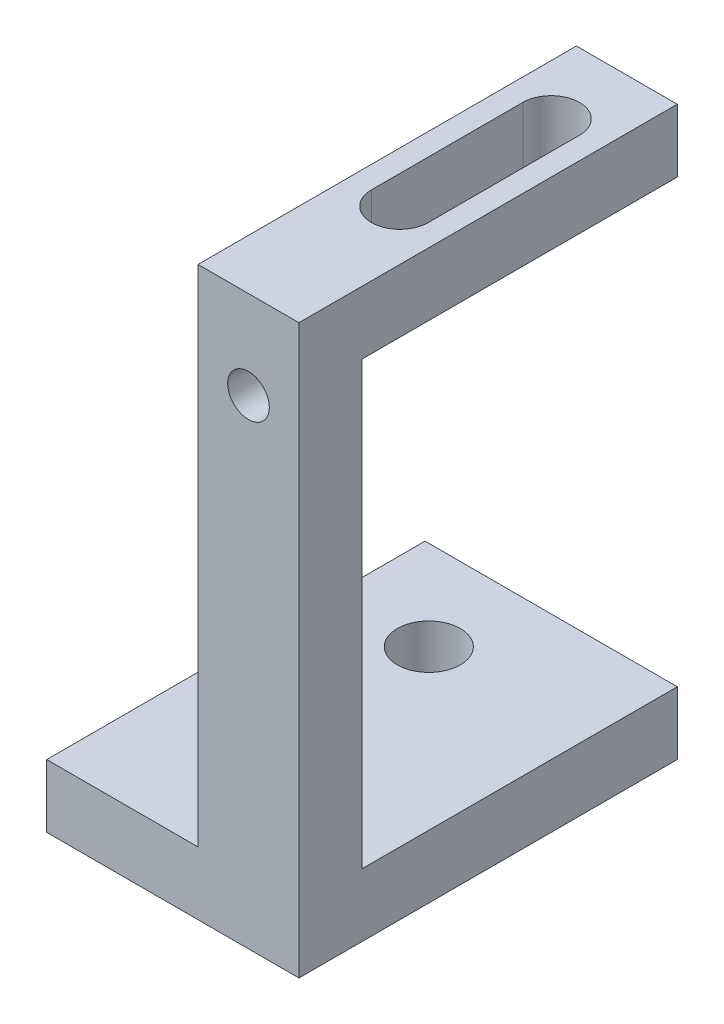
ISO-10303-21;
HEADER;
FILE_DESCRIPTION(('STEP AP214'),'2;1');
FILE_NAME('part.step','',(''),(''),'','','');
FILE_SCHEMA(('AUTOMOTIVE_DESIGN { 1 0 10303 214 1 1 1 1 }'));
ENDSEC;
DATA;
#1=APPLICATION_CONTEXT('core data for automotive mechanical design processes');
#2=APPLICATION_PROTOCOL_DEFINITION('international standard','automotive_design',2000,#1);
#3=PRODUCT_CONTEXT('',#1,'mechanical');
#4=PRODUCT('Part','Part','',(#3));
#5=PRODUCT_RELATED_PRODUCT_CATEGORY('part','',(#4));
#6=PRODUCT_DEFINITION_FORMATION('','',#4);
#7=PRODUCT_DEFINITION_CONTEXT('part definition',#1,'design');
#8=PRODUCT_DEFINITION('design','',#6,#7);
#9=PRODUCT_DEFINITION_SHAPE('','',#8);
#10=(LENGTH_UNIT() NAMED_UNIT(*) SI_UNIT(.MILLI.,.METRE.));
#11=(NAMED_UNIT(*) PLANE_ANGLE_UNIT() SI_UNIT($,.RADIAN.));
#12=(NAMED_UNIT(*) SI_UNIT($,.STERADIAN.) SOLID_ANGLE_UNIT());
#13=UNCERTAINTY_MEASURE_WITH_UNIT(LENGTH_MEASURE(1.E-05),#10,'distance_accuracy_value','');
#14=(GEOMETRIC_REPRESENTATION_CONTEXT(3) GLOBAL_UNCERTAINTY_ASSIGNED_CONTEXT((#13)) GLOBAL_UNIT_ASSIGNED_CONTEXT((#10,
#11,#12)) REPRESENTATION_CONTEXT('',''));
#15=CARTESIAN_POINT('',(0.,0.,0.));
#16=DIRECTION('',(0.,0.,1.));
#17=DIRECTION('',(1.,0.,0.));
#18=AXIS2_PLACEMENT_3D('',#15,#16,#17);
#19=CARTESIAN_POINT('',(0.,0.,10.));
#20=DIRECTION('',(1.,0.,0.));
#21=DIRECTION('',(0.,1.,0.));
#22=AXIS2_PLACEMENT_3D('',#19,#20,#21);
#23=PLANE('',#22);
#24=DIRECTION('',(0.,0.,-1.));
#25=VECTOR('',#24,1.);
#26=CARTESIAN_POINT('',(0.,15.,5.));
#27=LINE('',#26,#25);
#28=CARTESIAN_POINT('',(0.,15.,5.));
#29=VERTEX_POINT('',#28);
#30=CARTESIAN_POINT('',(0.,15.,-20.));
#31=VERTEX_POINT('',#30);
#32=EDGE_CURVE('E225',#29,#31,#27,.T.);
#33=ORIENTED_EDGE('',*,*,#32,.F.);
#34=DIRECTION('',(0.,1.,0.));
#35=VECTOR('',#34,1.);
#36=CARTESIAN_POINT('',(0.,0.,5.));
#37=LINE('',#36,#35);
#38=CARTESIAN_POINT('',(0.,-20.,5.));
#39=VERTEX_POINT('',#38);
#40=EDGE_CURVE('E222',#39,#29,#37,.T.);
#41=ORIENTED_EDGE('',*,*,#40,.F.);
#42=DIRECTION('',(0.,0.,-1.));
#43=VECTOR('',#42,1.);
#44=CARTESIAN_POINT('',(0.,-20.,5.));
#45=LINE('',#44,#43);
#46=CARTESIAN_POINT('',(0.,-20.,10.));
#47=VERTEX_POINT('',#46);
#48=EDGE_CURVE('E216',#47,#39,#45,.T.);
#49=ORIENTED_EDGE('',*,*,#48,.F.);
#50=DIRECTION('',(0.,-1.,0.));
#51=VECTOR('',#50,1.);
#52=CARTESIAN_POINT('',(0.,0.,10.));
#53=LINE('',#52,#51);
#54=CARTESIAN_POINT('',(0.,20.,10.));
#55=VERTEX_POINT('',#54);
#56=EDGE_CURVE('E231',#55,#47,#53,.T.);
#57=ORIENTED_EDGE('',*,*,#56,.F.);
#58=DIRECTION('',(0.,0.,-1.));
#59=VECTOR('',#58,1.);
#60=CARTESIAN_POINT('',(0.,20.,10.));
#61=LINE('',#60,#59);
#62=CARTESIAN_POINT('',(0.,20.,-20.));
#63=VERTEX_POINT('',#62);
#64=EDGE_CURVE('E237',#55,#63,#61,.T.);
#65=ORIENTED_EDGE('',*,*,#64,.T.);
#66=DIRECTION('',(0.,1.,0.));
#67=VECTOR('',#66,1.);
#68=CARTESIAN_POINT('',(0.,20.,-20.));
#69=LINE('',#68,#67);
#70=EDGE_CURVE('E177',#31,#63,#69,.T.);
#71=ORIENTED_EDGE('',*,*,#70,.F.);
#72=EDGE_LOOP('',(#33,#41,#49,#57,#65,#71));
#73=FACE_BOUND('',#72,.T.);
#74=ADVANCED_FACE('F49',(#73),#23,.F.);
#75=CARTESIAN_POINT('',(8.,0.,10.));
#76=DIRECTION('',(-1.,0.,0.));
#77=DIRECTION('',(0.,-1.,0.));
#78=AXIS2_PLACEMENT_3D('',#75,#76,#77);
#79=PLANE('',#78);
#80=DIRECTION('',(0.,1.,0.));
#81=VECTOR('',#80,1.);
#82=CARTESIAN_POINT('',(8.,0.,10.));
#83=LINE('',#82,#81);
#84=CARTESIAN_POINT('',(8.,-25.,10.));
#85=VERTEX_POINT('',#84);
#86=CARTESIAN_POINT('',(8.,20.,10.));
#87=VERTEX_POINT('',#86);
#88=EDGE_CURVE('E233',#85,#87,#83,.T.);
#89=ORIENTED_EDGE('',*,*,#88,.F.);
#90=DIRECTION('',(0.,0.,1.));
#91=VECTOR('',#90,1.);
#92=CARTESIAN_POINT('',(8.,-25.,10.));
#93=LINE('',#92,#91);
#94=CARTESIAN_POINT('',(8.,-25.,-20.));
#95=VERTEX_POINT('',#94);
#96=EDGE_CURVE('E190',#95,#85,#93,.T.);
#97=ORIENTED_EDGE('',*,*,#96,.F.);
#98=DIRECTION('',(0.,1.,0.));
#99=VECTOR('',#98,1.);
#100=CARTESIAN_POINT('',(8.,-25.,-20.));
#101=LINE('',#100,#99);
#102=CARTESIAN_POINT('',(8.,-20.,-20.));
#103=VERTEX_POINT('',#102);
#104=EDGE_CURVE('E200',#95,#103,#101,.T.);
#105=ORIENTED_EDGE('',*,*,#104,.T.);
#106=DIRECTION('',(0.,0.,1.));
#107=VECTOR('',#106,1.);
#108=CARTESIAN_POINT('',(8.,-20.,10.));
#109=LINE('',#108,#107);
#110=CARTESIAN_POINT('',(8.,-20.,5.));
#111=VERTEX_POINT('',#110);
#112=EDGE_CURVE('E187',#103,#111,#109,.T.);
#113=ORIENTED_EDGE('',*,*,#112,.T.);
#114=DIRECTION('',(0.,1.,0.));
#115=VECTOR('',#114,1.);
#116=CARTESIAN_POINT('',(8.,0.,5.));
#117=LINE('',#116,#115);
#118=CARTESIAN_POINT('',(8.,15.,5.));
#119=VERTEX_POINT('',#118);
#120=EDGE_CURVE('E241',#111,#119,#117,.T.);
#121=ORIENTED_EDGE('',*,*,#120,.T.);
#122=DIRECTION('',(0.,0.,-1.));
#123=VECTOR('',#122,1.);
#124=CARTESIAN_POINT('',(8.,15.,9.99999999999998));
#125=LINE('',#124,#123);
#126=CARTESIAN_POINT('',(8.,15.,-20.));
#127=VERTEX_POINT('',#126);
#128=EDGE_CURVE('E229',#119,#127,#125,.T.);
#129=ORIENTED_EDGE('',*,*,#128,.T.);
#130=DIRECTION('',(0.,-1.,0.));
#131=VECTOR('',#130,1.);
#132=CARTESIAN_POINT('',(8.,20.,-20.));
#133=LINE('',#132,#131);
#134=CARTESIAN_POINT('',(8.,20.,-20.));
#135=VERTEX_POINT('',#134);
#136=EDGE_CURVE('E169',#135,#127,#133,.T.);
#137=ORIENTED_EDGE('',*,*,#136,.F.);
#138=DIRECTION('',(0.,0.,-1.));
#139=VECTOR('',#138,1.);
#140=CARTESIAN_POINT('',(8.,20.,10.));
#141=LINE('',#140,#139);
#142=EDGE_CURVE('E239',#87,#135,#141,.T.);
#143=ORIENTED_EDGE('',*,*,#142,.F.);
#144=EDGE_LOOP('',(#89,#97,#105,#113,#121,#129,#137,#143));
#145=FACE_BOUND('',#144,.T.);
#146=ADVANCED_FACE('F267',(#145),#79,.F.);
#147=CARTESIAN_POINT('',(0.,20.,10.));
#148=DIRECTION('',(0.,-1.,0.));
#149=DIRECTION('',(0.,0.,-1.));
#150=AXIS2_PLACEMENT_3D('',#147,#148,#149);
#151=PLANE('',#150);
#152=DIRECTION('',(0.,0.,1.));
#153=VECTOR('',#152,1.);
#154=CARTESIAN_POINT('',(1.75,20.,-14.));
#155=LINE('',#154,#153);
#156=CARTESIAN_POINT('',(1.75,20.,-14.));
#157=VERTEX_POINT('',#156);
#158=CARTESIAN_POINT('',(1.75,20.,-2.));
#159=VERTEX_POINT('',#158);
#160=EDGE_CURVE('E155',#157,#159,#155,.T.);
#161=ORIENTED_EDGE('',*,*,#160,.F.);
#162=CARTESIAN_POINT('',(4.,20.,-14.));
#163=DIRECTION('',(0.,1.,0.));
#164=DIRECTION('',(0.,0.,1.));
#165=AXIS2_PLACEMENT_3D('',#162,#163,#164);
#166=CIRCLE('',#165,2.25);
#167=CARTESIAN_POINT('',(6.25,20.,-14.));
#168=VERTEX_POINT('',#167);
#169=EDGE_CURVE('E63',#168,#157,#166,.T.);
#170=ORIENTED_EDGE('',*,*,#169,.F.);
#171=DIRECTION('',(0.,0.,-1.));
#172=VECTOR('',#171,1.);
#173=CARTESIAN_POINT('',(6.25,20.,-14.));
#174=LINE('',#173,#172);
#175=CARTESIAN_POINT('',(6.25,20.,-2.));
#176=VERTEX_POINT('',#175);
#177=EDGE_CURVE('E162',#176,#168,#174,.T.);
#178=ORIENTED_EDGE('',*,*,#177,.F.);
#179=CARTESIAN_POINT('',(4.,20.,-2.));
#180=DIRECTION('',(0.,1.,0.));
#181=DIRECTION('',(0.,0.,1.));
#182=AXIS2_PLACEMENT_3D('',#179,#180,#181);
#183=CIRCLE('',#182,2.25);
#184=EDGE_CURVE('E146',#159,#176,#183,.T.);
#185=ORIENTED_EDGE('',*,*,#184,.F.);
#186=EDGE_LOOP('',(#161,#170,#178,#185));
#187=FACE_BOUND('',#186,.T.);
#188=ORIENTED_EDGE('',*,*,#142,.T.);
#189=DIRECTION('',(1.,0.,0.));
#190=VECTOR('',#189,1.);
#191=CARTESIAN_POINT('',(8.,20.,-20.));
#192=LINE('',#191,#190);
#193=EDGE_CURVE('E180',#63,#135,#192,.T.);
#194=ORIENTED_EDGE('',*,*,#193,.F.);
#195=ORIENTED_EDGE('',*,*,#64,.F.);
#196=DIRECTION('',(-1.,0.,0.));
#197=VECTOR('',#196,1.);
#198=CARTESIAN_POINT('',(0.,20.,10.));
#199=LINE('',#198,#197);
#200=EDGE_CURVE('E235',#87,#55,#199,.T.);
#201=ORIENTED_EDGE('',*,*,#200,.F.);
#202=EDGE_LOOP('',(#188,#194,#195,#201));
#203=FACE_BOUND('',#202,.T.);
#204=ADVANCED_FACE('F159',(#187,#203),#151,.F.);
#205=CARTESIAN_POINT('',(0.,0.,10.));
#206=DIRECTION('',(0.,0.,-1.));
#207=DIRECTION('',(-1.,0.,0.));
#208=AXIS2_PLACEMENT_3D('',#205,#206,#207);
#209=PLANE('',#208);
#210=CARTESIAN_POINT('',(4.,13.,10.));
#211=DIRECTION('',(0.,0.,1.));
#212=DIRECTION('',(1.,0.,0.));
#213=AXIS2_PLACEMENT_3D('',#210,#211,#212);
#214=CIRCLE('',#213,1.65);
#215=CARTESIAN_POINT('',(5.65,13.,10.));
#216=VERTEX_POINT('',#215);
#217=EDGE_CURVE('E419',#216,#216,#214,.T.);
#218=ORIENTED_EDGE('',*,*,#217,.F.);
#219=EDGE_LOOP('',(#218));
#220=FACE_BOUND('',#219,.T.);
#221=ORIENTED_EDGE('',*,*,#56,.T.);
#222=DIRECTION('',(-1.,0.,0.));
#223=VECTOR('',#222,1.);
#224=CARTESIAN_POINT('',(8.,-20.,10.));
#225=LINE('',#224,#223);
#226=CARTESIAN_POINT('',(-12.,-20.,10.));
#227=VERTEX_POINT('',#226);
#228=EDGE_CURVE('E203',#47,#227,#225,.T.);
#229=ORIENTED_EDGE('',*,*,#228,.T.);
#230=DIRECTION('',(0.,1.,0.));
#231=VECTOR('',#230,1.);
#232=CARTESIAN_POINT('',(-12.,-25.,10.));
#233=LINE('',#232,#231);
#234=CARTESIAN_POINT('',(-12.,-25.,10.));
#235=VERTEX_POINT('',#234);
#236=EDGE_CURVE('E213',#235,#227,#233,.T.);
#237=ORIENTED_EDGE('',*,*,#236,.F.);
#238=DIRECTION('',(-1.,0.,0.));
#239=VECTOR('',#238,1.);
#240=CARTESIAN_POINT('',(8.,-25.,10.));
#241=LINE('',#240,#239);
#242=EDGE_CURVE('E193',#85,#235,#241,.T.);
#243=ORIENTED_EDGE('',*,*,#242,.F.);
#244=ORIENTED_EDGE('',*,*,#88,.T.);
#245=ORIENTED_EDGE('',*,*,#200,.T.);
#246=EDGE_LOOP('',(#221,#229,#237,#243,#244,#245));
#247=FACE_BOUND('',#246,.T.);
#248=ADVANCED_FACE('F293',(#220,#247),#209,.F.);
#249=CARTESIAN_POINT('',(10.,0.,5.));
#250=DIRECTION('',(0.,0.,1.));
#251=DIRECTION('',(1.,0.,0.));
#252=AXIS2_PLACEMENT_3D('',#249,#250,#251);
#253=PLANE('',#252);
#254=CARTESIAN_POINT('',(4.,13.,5.));
#255=DIRECTION('',(0.,0.,1.));
#256=DIRECTION('',(1.,0.,0.));
#257=AXIS2_PLACEMENT_3D('',#254,#255,#256);
#258=CIRCLE('',#257,1.65);
#259=CARTESIAN_POINT('',(5.65,13.,5.));
#260=VERTEX_POINT('',#259);
#261=EDGE_CURVE('E422',#260,#260,#258,.T.);
#262=ORIENTED_EDGE('',*,*,#261,.T.);
#263=EDGE_LOOP('',(#262));
#264=FACE_BOUND('',#263,.T.);
#265=ORIENTED_EDGE('',*,*,#120,.F.);
#266=DIRECTION('',(1.,0.,0.));
#267=VECTOR('',#266,1.);
#268=CARTESIAN_POINT('',(0.,-20.,5.));
#269=LINE('',#268,#267);
#270=EDGE_CURVE('E219',#39,#111,#269,.T.);
#271=ORIENTED_EDGE('',*,*,#270,.F.);
#272=ORIENTED_EDGE('',*,*,#40,.T.);
#273=DIRECTION('',(-1.,0.,0.));
#274=VECTOR('',#273,1.);
#275=CARTESIAN_POINT('',(10.,15.,5.));
#276=LINE('',#275,#274);
#277=EDGE_CURVE('E227',#119,#29,#276,.T.);
#278=ORIENTED_EDGE('',*,*,#277,.F.);
#279=EDGE_LOOP('',(#265,#271,#272,#278));
#280=FACE_BOUND('',#279,.T.);
#281=ADVANCED_FACE('F284',(#264,#280),#253,.F.);
#282=CARTESIAN_POINT('',(10.,15.,5.));
#283=DIRECTION('',(0.,1.,0.));
#284=DIRECTION('',(0.,0.,1.));
#285=AXIS2_PLACEMENT_3D('',#282,#283,#284);
#286=PLANE('',#285);
#287=DIRECTION('',(0.,0.,-1.));
#288=VECTOR('',#287,1.);
#289=CARTESIAN_POINT('',(6.25,15.,5.));
#290=LINE('',#289,#288);
#291=CARTESIAN_POINT('',(6.25,15.,-2.));
#292=VERTEX_POINT('',#291);
#293=CARTESIAN_POINT('',(6.25,15.,-14.));
#294=VERTEX_POINT('',#293);
#295=EDGE_CURVE('E56',#292,#294,#290,.T.);
#296=ORIENTED_EDGE('',*,*,#295,.T.);
#297=CARTESIAN_POINT('',(4.,15.,-14.));
#298=DIRECTION('',(0.,1.,0.));
#299=DIRECTION('',(0.,0.,1.));
#300=AXIS2_PLACEMENT_3D('',#297,#298,#299);
#301=CIRCLE('',#300,2.25);
#302=CARTESIAN_POINT('',(1.75,15.,-14.));
#303=VERTEX_POINT('',#302);
#304=EDGE_CURVE('E13',#294,#303,#301,.T.);
#305=ORIENTED_EDGE('',*,*,#304,.T.);
#306=DIRECTION('',(0.,0.,1.));
#307=VECTOR('',#306,1.);
#308=CARTESIAN_POINT('',(1.75,15.,5.));
#309=LINE('',#308,#307);
#310=CARTESIAN_POINT('',(1.75,15.,-2.));
#311=VERTEX_POINT('',#310);
#312=EDGE_CURVE('E244',#303,#311,#309,.T.);
#313=ORIENTED_EDGE('',*,*,#312,.T.);
#314=CARTESIAN_POINT('',(4.,15.,-2.));
#315=DIRECTION('',(0.,1.,0.));
#316=DIRECTION('',(0.,0.,1.));
#317=AXIS2_PLACEMENT_3D('',#314,#315,#316);
#318=CIRCLE('',#317,2.25);
#319=EDGE_CURVE('E149',#311,#292,#318,.T.);
#320=ORIENTED_EDGE('',*,*,#319,.T.);
#321=EDGE_LOOP('',(#296,#305,#313,#320));
#322=FACE_BOUND('',#321,.T.);
#323=ORIENTED_EDGE('',*,*,#277,.T.);
#324=ORIENTED_EDGE('',*,*,#32,.T.);
#325=DIRECTION('',(-1.,0.,0.));
#326=VECTOR('',#325,1.);
#327=CARTESIAN_POINT('',(8.,15.,-20.));
#328=LINE('',#327,#326);
#329=EDGE_CURVE('E174',#127,#31,#328,.T.);
#330=ORIENTED_EDGE('',*,*,#329,.F.);
#331=ORIENTED_EDGE('',*,*,#128,.F.);
#332=EDGE_LOOP('',(#323,#324,#330,#331));
#333=FACE_BOUND('',#332,.T.);
#334=ADVANCED_FACE('F248',(#322,#333),#286,.F.);
#335=CARTESIAN_POINT('',(-12.,-25.,10.));
#336=DIRECTION('',(1.,0.,0.));
#337=DIRECTION('',(0.,0.,-1.));
#338=AXIS2_PLACEMENT_3D('',#335,#336,#337);
#339=PLANE('',#338);
#340=DIRECTION('',(0.,0.,-1.));
#341=VECTOR('',#340,1.);
#342=CARTESIAN_POINT('',(-12.,-20.,10.));
#343=LINE('',#342,#341);
#344=CARTESIAN_POINT('',(-12.,-20.,-20.));
#345=VERTEX_POINT('',#344);
#346=EDGE_CURVE('E205',#227,#345,#343,.T.);
#347=ORIENTED_EDGE('',*,*,#346,.T.);
#348=DIRECTION('',(0.,1.,0.));
#349=VECTOR('',#348,1.);
#350=CARTESIAN_POINT('',(-12.,-25.,-20.));
#351=LINE('',#350,#349);
#352=CARTESIAN_POINT('',(-12.,-25.,-20.));
#353=VERTEX_POINT('',#352);
#354=EDGE_CURVE('E210',#353,#345,#351,.T.);
#355=ORIENTED_EDGE('',*,*,#354,.F.);
#356=DIRECTION('',(0.,0.,-1.));
#357=VECTOR('',#356,1.);
#358=CARTESIAN_POINT('',(-12.,-25.,10.));
#359=LINE('',#358,#357);
#360=EDGE_CURVE('E196',#235,#353,#359,.T.);
#361=ORIENTED_EDGE('',*,*,#360,.F.);
#362=ORIENTED_EDGE('',*,*,#236,.T.);
#363=EDGE_LOOP('',(#347,#355,#361,#362));
#364=FACE_BOUND('',#363,.T.);
#365=ADVANCED_FACE('F309',(#364),#339,.F.);
#366=CARTESIAN_POINT('',(8.,-25.,-20.));
#367=DIRECTION('',(0.,0.,1.));
#368=DIRECTION('',(1.,0.,0.));
#369=AXIS2_PLACEMENT_3D('',#366,#367,#368);
#370=PLANE('',#369);
#371=DIRECTION('',(1.,0.,0.));
#372=VECTOR('',#371,1.);
#373=CARTESIAN_POINT('',(8.,-20.,-20.));
#374=LINE('',#373,#372);
#375=EDGE_CURVE('E194',#345,#103,#374,.T.);
#376=ORIENTED_EDGE('',*,*,#375,.T.);
#377=ORIENTED_EDGE('',*,*,#104,.F.);
#378=DIRECTION('',(1.,0.,0.));
#379=VECTOR('',#378,1.);
#380=CARTESIAN_POINT('',(8.,-25.,-20.));
#381=LINE('',#380,#379);
#382=EDGE_CURVE('E198',#353,#95,#381,.T.);
#383=ORIENTED_EDGE('',*,*,#382,.F.);
#384=ORIENTED_EDGE('',*,*,#354,.T.);
#385=EDGE_LOOP('',(#376,#377,#383,#384));
#386=FACE_BOUND('',#385,.T.);
#387=ADVANCED_FACE('F312',(#386),#370,.F.);
#388=CARTESIAN_POINT('',(0.,-25.,0.));
#389=DIRECTION('',(0.,1.,0.));
#390=DIRECTION('',(0.,0.,1.));
#391=AXIS2_PLACEMENT_3D('',#388,#389,#390);
#392=PLANE('',#391);
#393=CARTESIAN_POINT('',(-4.60000000000237,-25.,-12.8978974111214));
#394=DIRECTION('',(0.,1.,0.));
#395=DIRECTION('',(0.,0.,1.));
#396=AXIS2_PLACEMENT_3D('',#393,#394,#395);
#397=CIRCLE('',#396,2.5);
#398=CARTESIAN_POINT('',(-4.60000000000237,-25.,-10.3978974111214));
#399=VERTEX_POINT('',#398);
#400=EDGE_CURVE('E184',#399,#399,#397,.T.);
#401=ORIENTED_EDGE('',*,*,#400,.T.);
#402=EDGE_LOOP('',(#401));
#403=FACE_BOUND('',#402,.T.);
#404=ORIENTED_EDGE('',*,*,#96,.T.);
#405=ORIENTED_EDGE('',*,*,#242,.T.);
#406=ORIENTED_EDGE('',*,*,#360,.T.);
#407=ORIENTED_EDGE('',*,*,#382,.T.);
#408=EDGE_LOOP('',(#404,#405,#406,#407));
#409=FACE_BOUND('',#408,.T.);
#410=ADVANCED_FACE('F316',(#403,#409),#392,.F.);
#411=CARTESIAN_POINT('',(0.,-20.,0.));
#412=DIRECTION('',(0.,1.,0.));
#413=DIRECTION('',(0.,0.,1.));
#414=AXIS2_PLACEMENT_3D('',#411,#412,#413);
#415=PLANE('',#414);
#416=CARTESIAN_POINT('',(-4.60000000000237,-20.,-12.8978974111214));
#417=DIRECTION('',(0.,1.,0.));
#418=DIRECTION('',(0.,0.,1.));
#419=AXIS2_PLACEMENT_3D('',#416,#417,#418);
#420=CIRCLE('',#419,2.5);
#421=CARTESIAN_POINT('',(-4.60000000000237,-20.,-10.3978974111214));
#422=VERTEX_POINT('',#421);
#423=EDGE_CURVE('E183',#422,#422,#420,.T.);
#424=ORIENTED_EDGE('',*,*,#423,.F.);
#425=EDGE_LOOP('',(#424));
#426=FACE_BOUND('',#425,.T.);
#427=ORIENTED_EDGE('',*,*,#228,.F.);
#428=ORIENTED_EDGE('',*,*,#48,.T.);
#429=ORIENTED_EDGE('',*,*,#270,.T.);
#430=ORIENTED_EDGE('',*,*,#112,.F.);
#431=ORIENTED_EDGE('',*,*,#375,.F.);
#432=ORIENTED_EDGE('',*,*,#346,.F.);
#433=EDGE_LOOP('',(#427,#428,#429,#430,#431,#432));
#434=FACE_BOUND('',#433,.T.);
#435=ADVANCED_FACE('F288',(#426,#434),#415,.T.);
#436=CARTESIAN_POINT('',(-4.60000000000237,-25.,-12.8978974111214));
#437=DIRECTION('',(0.,1.,0.));
#438=DIRECTION('',(0.,0.,1.));
#439=AXIS2_PLACEMENT_3D('',#436,#437,#438);
#440=CYLINDRICAL_SURFACE('',#439,2.5);
#441=ORIENTED_EDGE('',*,*,#400,.F.);
#442=EDGE_LOOP('',(#441));
#443=FACE_BOUND('',#442,.T.);
#444=ORIENTED_EDGE('',*,*,#423,.T.);
#445=EDGE_LOOP('',(#444));
#446=FACE_BOUND('',#445,.T.);
#447=ADVANCED_FACE('F262',(#443,#446),#440,.F.);
#448=CARTESIAN_POINT('',(0.,0.,-20.));
#449=DIRECTION('',(0.,0.,-1.));
#450=DIRECTION('',(-1.,0.,0.));
#451=AXIS2_PLACEMENT_3D('',#448,#449,#450);
#452=PLANE('',#451);
#453=ORIENTED_EDGE('',*,*,#136,.T.);
#454=ORIENTED_EDGE('',*,*,#329,.T.);
#455=ORIENTED_EDGE('',*,*,#70,.T.);
#456=ORIENTED_EDGE('',*,*,#193,.T.);
#457=EDGE_LOOP('',(#453,#454,#455,#456));
#458=FACE_BOUND('',#457,.T.);
#459=ADVANCED_FACE('F255',(#458),#452,.T.);
#460=CARTESIAN_POINT('',(4.,10.,-14.));
#461=DIRECTION('',(0.,1.,0.));
#462=DIRECTION('',(0.,0.,1.));
#463=AXIS2_PLACEMENT_3D('',#460,#461,#462);
#464=CYLINDRICAL_SURFACE('',#463,2.25);
#465=DIRECTION('',(0.,1.,0.));
#466=VECTOR('',#465,1.);
#467=CARTESIAN_POINT('',(6.25,10.,-14.));
#468=LINE('',#467,#466);
#469=EDGE_CURVE('E167',#294,#168,#468,.T.);
#470=ORIENTED_EDGE('',*,*,#469,.T.);
#471=ORIENTED_EDGE('',*,*,#169,.T.);
#472=DIRECTION('',(0.,1.,0.));
#473=VECTOR('',#472,1.);
#474=CARTESIAN_POINT('',(1.75,10.,-14.));
#475=LINE('',#474,#473);
#476=EDGE_CURVE('E152',#303,#157,#475,.T.);
#477=ORIENTED_EDGE('',*,*,#476,.F.);
#478=ORIENTED_EDGE('',*,*,#304,.F.);
#479=EDGE_LOOP('',(#470,#471,#477,#478));
#480=FACE_BOUND('',#479,.T.);
#481=ADVANCED_FACE('F253',(#480),#464,.F.);
#482=CARTESIAN_POINT('',(6.25,10.,-14.));
#483=DIRECTION('',(1.,0.,0.));
#484=DIRECTION('',(0.,0.,-1.));
#485=AXIS2_PLACEMENT_3D('',#482,#483,#484);
#486=PLANE('',#485);
#487=DIRECTION('',(0.,1.,0.));
#488=VECTOR('',#487,1.);
#489=CARTESIAN_POINT('',(6.25,10.,-2.));
#490=LINE('',#489,#488);
#491=EDGE_CURVE('E151',#292,#176,#490,.T.);
#492=ORIENTED_EDGE('',*,*,#491,.T.);
#493=ORIENTED_EDGE('',*,*,#177,.T.);
#494=ORIENTED_EDGE('',*,*,#469,.F.);
#495=ORIENTED_EDGE('',*,*,#295,.F.);
#496=EDGE_LOOP('',(#492,#493,#494,#495));
#497=FACE_BOUND('',#496,.T.);
#498=ADVANCED_FACE('F252',(#497),#486,.F.);
#499=CARTESIAN_POINT('',(4.,10.,-2.));
#500=DIRECTION('',(0.,1.,0.));
#501=DIRECTION('',(0.,0.,1.));
#502=AXIS2_PLACEMENT_3D('',#499,#500,#501);
#503=CYLINDRICAL_SURFACE('',#502,2.25);
#504=DIRECTION('',(0.,1.,0.));
#505=VECTOR('',#504,1.);
#506=CARTESIAN_POINT('',(1.75,10.,-2.));
#507=LINE('',#506,#505);
#508=EDGE_CURVE('E71',#311,#159,#507,.T.);
#509=ORIENTED_EDGE('',*,*,#508,.T.);
#510=ORIENTED_EDGE('',*,*,#184,.T.);
#511=ORIENTED_EDGE('',*,*,#491,.F.);
#512=ORIENTED_EDGE('',*,*,#319,.F.);
#513=EDGE_LOOP('',(#509,#510,#511,#512));
#514=FACE_BOUND('',#513,.T.);
#515=ADVANCED_FACE('F143',(#514),#503,.F.);
#516=CARTESIAN_POINT('',(1.75,10.,-14.));
#517=DIRECTION('',(-1.,0.,0.));
#518=DIRECTION('',(0.,0.,1.));
#519=AXIS2_PLACEMENT_3D('',#516,#517,#518);
#520=PLANE('',#519);
#521=ORIENTED_EDGE('',*,*,#476,.T.);
#522=ORIENTED_EDGE('',*,*,#160,.T.);
#523=ORIENTED_EDGE('',*,*,#508,.F.);
#524=ORIENTED_EDGE('',*,*,#312,.F.);
#525=EDGE_LOOP('',(#521,#522,#523,#524));
#526=FACE_BOUND('',#525,.T.);
#527=ADVANCED_FACE('F156',(#526),#520,.F.);
#528=CARTESIAN_POINT('',(4.,13.,10.));
#529=DIRECTION('',(0.,0.,1.));
#530=DIRECTION('',(1.,0.,0.));
#531=AXIS2_PLACEMENT_3D('',#528,#529,#530);
#532=CYLINDRICAL_SURFACE('',#531,1.65);
#533=ORIENTED_EDGE('',*,*,#217,.T.);
#534=EDGE_LOOP('',(#533));
#535=FACE_BOUND('',#534,.T.);
#536=ORIENTED_EDGE('',*,*,#261,.F.);
#537=EDGE_LOOP('',(#536));
#538=FACE_BOUND('',#537,.T.);
#539=ADVANCED_FACE('F386',(#535,#538),#532,.F.);
#540=CLOSED_SHELL('',(#74,#146,#204,#248,#281,#334,#365,#387,#410,#435,#447,#459,#481,#498,#515,
#527,#539));
#541=MANIFOLD_SOLID_BREP('B2',#540);
#542=ADVANCED_BREP_SHAPE_REPRESENTATION('',(#18,#541),#14);
#543=SHAPE_DEFINITION_REPRESENTATION(#9,#542);
ENDSEC;
END-ISO-10303-21;
